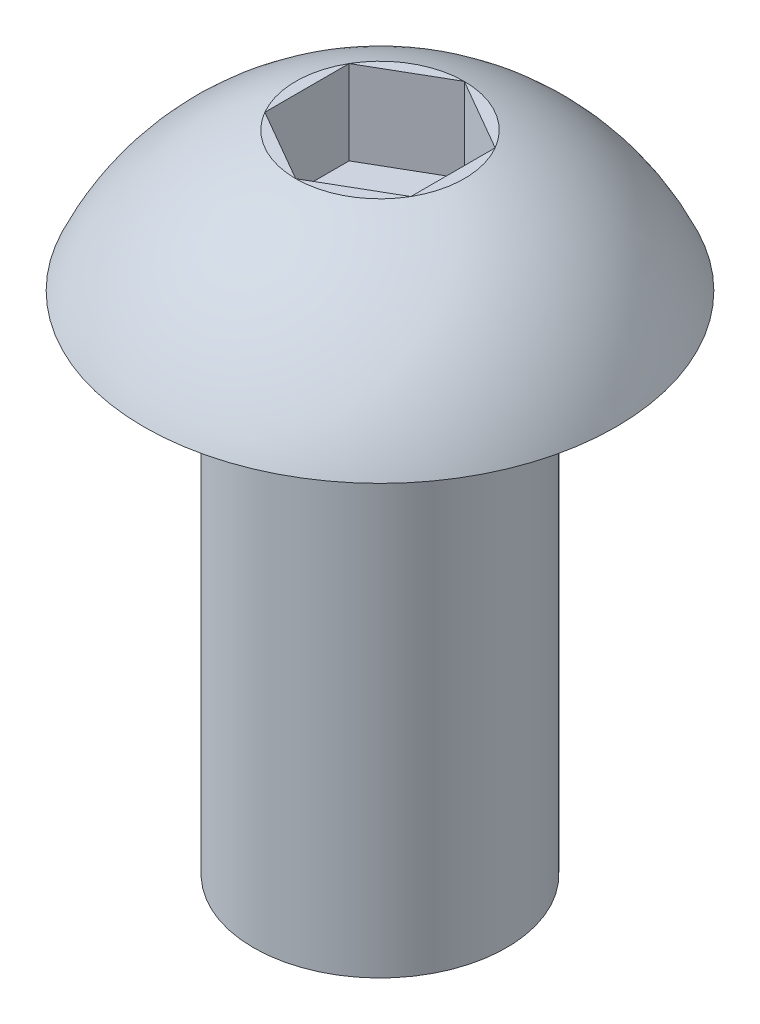
ISO-10303-21;
HEADER;
FILE_DESCRIPTION(('STEP AP214'),'2;1');
FILE_NAME('part.step','',(''),(''),'','','');
FILE_SCHEMA(('AUTOMOTIVE_DESIGN { 1 0 10303 214 1 1 1 1 }'));
ENDSEC;
DATA;
#1=APPLICATION_CONTEXT('core data for automotive mechanical design processes');
#2=APPLICATION_PROTOCOL_DEFINITION('international standard','automotive_design',2000,#1);
#3=PRODUCT_CONTEXT('',#1,'mechanical');
#4=PRODUCT('Part','Part','',(#3));
#5=PRODUCT_RELATED_PRODUCT_CATEGORY('part','',(#4));
#6=PRODUCT_DEFINITION_FORMATION('','',#4);
#7=PRODUCT_DEFINITION_CONTEXT('part definition',#1,'design');
#8=PRODUCT_DEFINITION('design','',#6,#7);
#9=PRODUCT_DEFINITION_SHAPE('','',#8);
#10=(LENGTH_UNIT() NAMED_UNIT(*) SI_UNIT(.MILLI.,.METRE.));
#11=(NAMED_UNIT(*) PLANE_ANGLE_UNIT() SI_UNIT($,.RADIAN.));
#12=(NAMED_UNIT(*) SI_UNIT($,.STERADIAN.) SOLID_ANGLE_UNIT());
#13=UNCERTAINTY_MEASURE_WITH_UNIT(LENGTH_MEASURE(1.E-05),#10,'distance_accuracy_value','');
#14=(GEOMETRIC_REPRESENTATION_CONTEXT(3) GLOBAL_UNCERTAINTY_ASSIGNED_CONTEXT((#13)) GLOBAL_UNIT_ASSIGNED_CONTEXT((#10,
#11,#12)) REPRESENTATION_CONTEXT('',''));
#15=CARTESIAN_POINT('',(0.,0.,0.));
#16=DIRECTION('',(0.,0.,1.));
#17=DIRECTION('',(1.,0.,0.));
#18=AXIS2_PLACEMENT_3D('',#15,#16,#17);
#19=CARTESIAN_POINT('',(0.,1.65,0.));
#20=DIRECTION('',(0.,1.,0.));
#21=DIRECTION('',(0.,0.,1.));
#22=AXIS2_PLACEMENT_3D('',#19,#20,#21);
#23=PLANE('',#22);
#24=DIRECTION('',(-0.866025403784439,0.,-0.5));
#25=VECTOR('',#24,1.);
#26=CARTESIAN_POINT('',(0.866025403784438,1.65,-0.5));
#27=LINE('',#26,#25);
#28=CARTESIAN_POINT('',(0.866025403784438,1.65,-0.5));
#29=VERTEX_POINT('',#28);
#30=CARTESIAN_POINT('',(0.,1.65,-1.));
#31=VERTEX_POINT('',#30);
#32=EDGE_CURVE('E50',#29,#31,#27,.T.);
#33=ORIENTED_EDGE('',*,*,#32,.F.);
#34=CARTESIAN_POINT('',(0.,1.65,0.));
#35=DIRECTION('',(0.,1.,0.));
#36=DIRECTION('',(0.,0.,1.));
#37=AXIS2_PLACEMENT_3D('',#34,#35,#36);
#38=CIRCLE('',#37,1.);
#39=EDGE_CURVE('E152',#29,#31,#38,.T.);
#40=ORIENTED_EDGE('',*,*,#39,.T.);
#41=EDGE_LOOP('',(#33,#40));
#42=FACE_BOUND('',#41,.T.);
#43=ADVANCED_FACE('F34',(#42),#23,.T.);
#44=DIRECTION('',(0.,0.,-1.));
#45=VECTOR('',#44,1.);
#46=CARTESIAN_POINT('',(0.866025403784439,1.65,0.5));
#47=LINE('',#46,#45);
#48=CARTESIAN_POINT('',(0.866025403784439,1.65,0.5));
#49=VERTEX_POINT('',#48);
#50=EDGE_CURVE('E133',#49,#29,#47,.T.);
#51=ORIENTED_EDGE('',*,*,#50,.F.);
#52=EDGE_CURVE('E147',#49,#29,#38,.T.);
#53=ORIENTED_EDGE('',*,*,#52,.T.);
#54=EDGE_LOOP('',(#51,#53));
#55=FACE_BOUND('',#54,.T.);
#56=ADVANCED_FACE('F175',(#55),#23,.T.);
#57=DIRECTION('',(0.866025403784439,0.,-0.5));
#58=VECTOR('',#57,1.);
#59=CARTESIAN_POINT('',(0.,1.65,1.));
#60=LINE('',#59,#58);
#61=CARTESIAN_POINT('',(0.,1.65,1.));
#62=VERTEX_POINT('',#61);
#63=EDGE_CURVE('E131',#62,#49,#60,.T.);
#64=ORIENTED_EDGE('',*,*,#63,.F.);
#65=EDGE_CURVE('E145',#62,#49,#38,.T.);
#66=ORIENTED_EDGE('',*,*,#65,.T.);
#67=EDGE_LOOP('',(#64,#66));
#68=FACE_BOUND('',#67,.T.);
#69=ADVANCED_FACE('F177',(#68),#23,.T.);
#70=DIRECTION('',(0.866025403784439,0.,0.5));
#71=VECTOR('',#70,1.);
#72=CARTESIAN_POINT('',(-0.866025403784439,1.65,0.5));
#73=LINE('',#72,#71);
#74=CARTESIAN_POINT('',(-0.866025403784439,1.65,0.5));
#75=VERTEX_POINT('',#74);
#76=EDGE_CURVE('E98',#75,#62,#73,.T.);
#77=ORIENTED_EDGE('',*,*,#76,.F.);
#78=EDGE_CURVE('E144',#75,#62,#38,.T.);
#79=ORIENTED_EDGE('',*,*,#78,.T.);
#80=EDGE_LOOP('',(#77,#79));
#81=FACE_BOUND('',#80,.T.);
#82=ADVANCED_FACE('F179',(#81),#23,.T.);
#83=DIRECTION('',(0.,0.,1.));
#84=VECTOR('',#83,1.);
#85=CARTESIAN_POINT('',(-0.866025403784439,1.65,-0.5));
#86=LINE('',#85,#84);
#87=CARTESIAN_POINT('',(-0.866025403784439,1.65,-0.5));
#88=VERTEX_POINT('',#87);
#89=EDGE_CURVE('E127',#88,#75,#86,.T.);
#90=ORIENTED_EDGE('',*,*,#89,.F.);
#91=EDGE_CURVE('E154',#88,#75,#38,.T.);
#92=ORIENTED_EDGE('',*,*,#91,.T.);
#93=EDGE_LOOP('',(#90,#92));
#94=FACE_BOUND('',#93,.T.);
#95=ADVANCED_FACE('F185',(#94),#23,.T.);
#96=CARTESIAN_POINT('',(0.,0.,0.));
#97=DIRECTION('',(0.,1.,0.));
#98=DIRECTION('',(0.,0.,1.));
#99=AXIS2_PLACEMENT_3D('',#96,#97,#98);
#100=PLANE('',#99);
#101=CARTESIAN_POINT('',(0.,0.,0.));
#102=DIRECTION('',(0.,-1.,0.));
#103=DIRECTION('',(0.,0.,-1.));
#104=AXIS2_PLACEMENT_3D('',#101,#102,#103);
#105=CIRCLE('',#104,1.5);
#106=CARTESIAN_POINT('',(0.,0.,-1.5));
#107=VERTEX_POINT('',#106);
#108=EDGE_CURVE('E11',#107,#107,#105,.T.);
#109=ORIENTED_EDGE('',*,*,#108,.F.);
#110=EDGE_LOOP('',(#109));
#111=FACE_BOUND('',#110,.T.);
#112=CARTESIAN_POINT('',(0.,0.,0.));
#113=DIRECTION('',(0.,1.,0.));
#114=DIRECTION('',(0.,0.,1.));
#115=AXIS2_PLACEMENT_3D('',#112,#113,#114);
#116=CIRCLE('',#115,2.8);
#117=CARTESIAN_POINT('',(0.,0.,2.8));
#118=VERTEX_POINT('',#117);
#119=EDGE_CURVE('E38',#118,#118,#116,.T.);
#120=ORIENTED_EDGE('',*,*,#119,.F.);
#121=EDGE_LOOP('',(#120));
#122=FACE_BOUND('',#121,.T.);
#123=ADVANCED_FACE('F36',(#111,#122),#100,.F.);
#124=CARTESIAN_POINT('',(0.,-1.19504109803139,0.));
#125=DIRECTION('',(0.,1.,0.));
#126=DIRECTION('',(0.,0.,1.));
#127=AXIS2_PLACEMENT_3D('',#124,#125,#126);
#128=DEGENERATE_TOROIDAL_SURFACE('',#127,0.0482956601378954,3.,.T.);
#129=ORIENTED_EDGE('',*,*,#65,.F.);
#130=ORIENTED_EDGE('',*,*,#78,.F.);
#131=ORIENTED_EDGE('',*,*,#91,.F.);
#132=EDGE_CURVE('E158',#31,#88,#38,.T.);
#133=ORIENTED_EDGE('',*,*,#132,.F.);
#134=ORIENTED_EDGE('',*,*,#39,.F.);
#135=ORIENTED_EDGE('',*,*,#52,.F.);
#136=EDGE_LOOP('',(#129,#130,#131,#133,#134,#135));
#137=FACE_BOUND('',#136,.T.);
#138=ORIENTED_EDGE('',*,*,#119,.T.);
#139=EDGE_LOOP('',(#138));
#140=FACE_BOUND('',#139,.T.);
#141=ADVANCED_FACE('F171',(#137,#140),#128,.T.);
#142=DIRECTION('',(-0.866025403784438,0.,0.5));
#143=VECTOR('',#142,1.);
#144=CARTESIAN_POINT('',(0.,1.65,-1.));
#145=LINE('',#144,#143);
#146=EDGE_CURVE('E124',#31,#88,#145,.T.);
#147=ORIENTED_EDGE('',*,*,#146,.F.);
#148=ORIENTED_EDGE('',*,*,#132,.T.);
#149=EDGE_LOOP('',(#147,#148));
#150=FACE_BOUND('',#149,.T.);
#151=ADVANCED_FACE('F186',(#150),#23,.T.);
#152=CARTESIAN_POINT('',(0.,-6.,0.));
#153=DIRECTION('',(0.,1.,0.));
#154=DIRECTION('',(0.,0.,1.));
#155=AXIS2_PLACEMENT_3D('',#152,#153,#154);
#156=CYLINDRICAL_SURFACE('',#155,1.5);
#157=CARTESIAN_POINT('',(0.,-6.,0.));
#158=DIRECTION('',(0.,-1.,0.));
#159=DIRECTION('',(0.,0.,-1.));
#160=AXIS2_PLACEMENT_3D('',#157,#158,#159);
#161=CIRCLE('',#160,1.5);
#162=CARTESIAN_POINT('',(0.,-6.,-1.5));
#163=VERTEX_POINT('',#162);
#164=EDGE_CURVE('E137',#163,#163,#161,.T.);
#165=ORIENTED_EDGE('',*,*,#164,.F.);
#166=EDGE_LOOP('',(#165));
#167=FACE_BOUND('',#166,.T.);
#168=ORIENTED_EDGE('',*,*,#108,.T.);
#169=EDGE_LOOP('',(#168));
#170=FACE_BOUND('',#169,.T.);
#171=ADVANCED_FACE('F192',(#167,#170),#156,.T.);
#172=CARTESIAN_POINT('',(0.,-6.,0.));
#173=DIRECTION('',(0.,-1.,0.));
#174=DIRECTION('',(0.,0.,-1.));
#175=AXIS2_PLACEMENT_3D('',#172,#173,#174);
#176=PLANE('',#175);
#177=ORIENTED_EDGE('',*,*,#164,.T.);
#178=EDGE_LOOP('',(#177));
#179=FACE_BOUND('',#178,.T.);
#180=ADVANCED_FACE('F197',(#179),#176,.T.);
#181=CARTESIAN_POINT('',(0.866025403784438,0.65,-0.5));
#182=DIRECTION('',(0.5,0.,-0.866025403784439));
#183=DIRECTION('',(-0.866025403784439,0.,-0.5));
#184=AXIS2_PLACEMENT_3D('',#181,#182,#183);
#185=PLANE('',#184);
#186=ORIENTED_EDGE('',*,*,#32,.T.);
#187=DIRECTION('',(0.,1.,0.));
#188=VECTOR('',#187,1.);
#189=CARTESIAN_POINT('',(0.,0.65,-1.));
#190=LINE('',#189,#188);
#191=CARTESIAN_POINT('',(0.,0.65,-1.));
#192=VERTEX_POINT('',#191);
#193=EDGE_CURVE('E80',#192,#31,#190,.T.);
#194=ORIENTED_EDGE('',*,*,#193,.F.);
#195=DIRECTION('',(-0.866025403784439,0.,-0.5));
#196=VECTOR('',#195,1.);
#197=CARTESIAN_POINT('',(0.866025403784438,0.65,-0.5));
#198=LINE('',#197,#196);
#199=CARTESIAN_POINT('',(0.866025403784438,0.65,-0.5));
#200=VERTEX_POINT('',#199);
#201=EDGE_CURVE('E135',#200,#192,#198,.T.);
#202=ORIENTED_EDGE('',*,*,#201,.F.);
#203=DIRECTION('',(0.,1.,0.));
#204=VECTOR('',#203,1.);
#205=CARTESIAN_POINT('',(0.866025403784438,0.65,-0.5));
#206=LINE('',#205,#204);
#207=EDGE_CURVE('E58',#200,#29,#206,.T.);
#208=ORIENTED_EDGE('',*,*,#207,.T.);
#209=EDGE_LOOP('',(#186,#194,#202,#208));
#210=FACE_BOUND('',#209,.T.);
#211=ADVANCED_FACE('F209',(#210),#185,.F.);
#212=CARTESIAN_POINT('',(0.866025403784439,0.65,0.5));
#213=DIRECTION('',(1.,0.,0.));
#214=DIRECTION('',(0.,0.,-1.));
#215=AXIS2_PLACEMENT_3D('',#212,#213,#214);
#216=PLANE('',#215);
#217=ORIENTED_EDGE('',*,*,#50,.T.);
#218=ORIENTED_EDGE('',*,*,#207,.F.);
#219=DIRECTION('',(0.,0.,-1.));
#220=VECTOR('',#219,1.);
#221=CARTESIAN_POINT('',(0.866025403784439,0.65,0.5));
#222=LINE('',#221,#220);
#223=CARTESIAN_POINT('',(0.866025403784439,0.65,0.5));
#224=VERTEX_POINT('',#223);
#225=EDGE_CURVE('E110',#224,#200,#222,.T.);
#226=ORIENTED_EDGE('',*,*,#225,.F.);
#227=DIRECTION('',(0.,1.,0.));
#228=VECTOR('',#227,1.);
#229=CARTESIAN_POINT('',(0.866025403784439,0.65,0.5));
#230=LINE('',#229,#228);
#231=EDGE_CURVE('E102',#224,#49,#230,.T.);
#232=ORIENTED_EDGE('',*,*,#231,.T.);
#233=EDGE_LOOP('',(#217,#218,#226,#232));
#234=FACE_BOUND('',#233,.T.);
#235=ADVANCED_FACE('F176',(#234),#216,.F.);
#236=CARTESIAN_POINT('',(0.,0.65,1.));
#237=DIRECTION('',(0.5,0.,0.866025403784439));
#238=DIRECTION('',(0.866025403784439,0.,-0.5));
#239=AXIS2_PLACEMENT_3D('',#236,#237,#238);
#240=PLANE('',#239);
#241=ORIENTED_EDGE('',*,*,#63,.T.);
#242=ORIENTED_EDGE('',*,*,#231,.F.);
#243=DIRECTION('',(0.866025403784439,0.,-0.5));
#244=VECTOR('',#243,1.);
#245=CARTESIAN_POINT('',(0.,0.65,1.));
#246=LINE('',#245,#244);
#247=CARTESIAN_POINT('',(0.,0.65,1.));
#248=VERTEX_POINT('',#247);
#249=EDGE_CURVE('E106',#248,#224,#246,.T.);
#250=ORIENTED_EDGE('',*,*,#249,.F.);
#251=DIRECTION('',(0.,1.,0.));
#252=VECTOR('',#251,1.);
#253=CARTESIAN_POINT('',(0.,0.65,1.));
#254=LINE('',#253,#252);
#255=EDGE_CURVE('E91',#248,#62,#254,.T.);
#256=ORIENTED_EDGE('',*,*,#255,.T.);
#257=EDGE_LOOP('',(#241,#242,#250,#256));
#258=FACE_BOUND('',#257,.T.);
#259=ADVANCED_FACE('F107',(#258),#240,.F.);
#260=CARTESIAN_POINT('',(-0.866025403784439,0.65,0.5));
#261=DIRECTION('',(-0.5,0.,0.866025403784439));
#262=DIRECTION('',(0.866025403784439,0.,0.5));
#263=AXIS2_PLACEMENT_3D('',#260,#261,#262);
#264=PLANE('',#263);
#265=ORIENTED_EDGE('',*,*,#76,.T.);
#266=ORIENTED_EDGE('',*,*,#255,.F.);
#267=DIRECTION('',(0.866025403784439,0.,0.5));
#268=VECTOR('',#267,1.);
#269=CARTESIAN_POINT('',(-0.866025403784439,0.65,0.5));
#270=LINE('',#269,#268);
#271=CARTESIAN_POINT('',(-0.866025403784439,0.65,0.5));
#272=VERTEX_POINT('',#271);
#273=EDGE_CURVE('E95',#272,#248,#270,.T.);
#274=ORIENTED_EDGE('',*,*,#273,.F.);
#275=DIRECTION('',(0.,1.,0.));
#276=VECTOR('',#275,1.);
#277=CARTESIAN_POINT('',(-0.866025403784439,0.65,0.5));
#278=LINE('',#277,#276);
#279=EDGE_CURVE('E103',#272,#75,#278,.T.);
#280=ORIENTED_EDGE('',*,*,#279,.T.);
#281=EDGE_LOOP('',(#265,#266,#274,#280));
#282=FACE_BOUND('',#281,.T.);
#283=ADVANCED_FACE('F93',(#282),#264,.F.);
#284=CARTESIAN_POINT('',(-0.866025403784439,0.65,-0.5));
#285=DIRECTION('',(-1.,0.,0.));
#286=DIRECTION('',(0.,0.,1.));
#287=AXIS2_PLACEMENT_3D('',#284,#285,#286);
#288=PLANE('',#287);
#289=ORIENTED_EDGE('',*,*,#89,.T.);
#290=ORIENTED_EDGE('',*,*,#279,.F.);
#291=DIRECTION('',(0.,0.,1.));
#292=VECTOR('',#291,1.);
#293=CARTESIAN_POINT('',(-0.866025403784439,0.65,-0.5));
#294=LINE('',#293,#292);
#295=CARTESIAN_POINT('',(-0.866025403784439,0.65,-0.5));
#296=VERTEX_POINT('',#295);
#297=EDGE_CURVE('E116',#296,#272,#294,.T.);
#298=ORIENTED_EDGE('',*,*,#297,.F.);
#299=DIRECTION('',(0.,1.,0.));
#300=VECTOR('',#299,1.);
#301=CARTESIAN_POINT('',(-0.866025403784439,0.65,-0.5));
#302=LINE('',#301,#300);
#303=EDGE_CURVE('E140',#296,#88,#302,.T.);
#304=ORIENTED_EDGE('',*,*,#303,.T.);
#305=EDGE_LOOP('',(#289,#290,#298,#304));
#306=FACE_BOUND('',#305,.T.);
#307=ADVANCED_FACE('F205',(#306),#288,.F.);
#308=CARTESIAN_POINT('',(0.,0.65,-1.));
#309=DIRECTION('',(-0.5,0.,-0.866025403784439));
#310=DIRECTION('',(-0.866025403784438,0.,0.5));
#311=AXIS2_PLACEMENT_3D('',#308,#309,#310);
#312=PLANE('',#311);
#313=ORIENTED_EDGE('',*,*,#146,.T.);
#314=ORIENTED_EDGE('',*,*,#303,.F.);
#315=DIRECTION('',(-0.866025403784438,0.,0.5));
#316=VECTOR('',#315,1.);
#317=CARTESIAN_POINT('',(0.,0.65,-1.));
#318=LINE('',#317,#316);
#319=EDGE_CURVE('E118',#192,#296,#318,.T.);
#320=ORIENTED_EDGE('',*,*,#319,.F.);
#321=ORIENTED_EDGE('',*,*,#193,.T.);
#322=EDGE_LOOP('',(#313,#314,#320,#321));
#323=FACE_BOUND('',#322,.T.);
#324=ADVANCED_FACE('F207',(#323),#312,.F.);
#325=CARTESIAN_POINT('',(0.,0.65,0.));
#326=DIRECTION('',(0.,1.,0.));
#327=DIRECTION('',(0.,0.,1.));
#328=AXIS2_PLACEMENT_3D('',#325,#326,#327);
#329=PLANE('',#328);
#330=ORIENTED_EDGE('',*,*,#201,.T.);
#331=ORIENTED_EDGE('',*,*,#319,.T.);
#332=ORIENTED_EDGE('',*,*,#297,.T.);
#333=ORIENTED_EDGE('',*,*,#273,.T.);
#334=ORIENTED_EDGE('',*,*,#249,.T.);
#335=ORIENTED_EDGE('',*,*,#225,.T.);
#336=EDGE_LOOP('',(#330,#331,#332,#333,#334,#335));
#337=FACE_BOUND('',#336,.T.);
#338=ADVANCED_FACE('F113',(#337),#329,.T.);
#339=CLOSED_SHELL('',(#43,#56,#69,#82,#95,#123,#141,#151,#171,#180,#211,#235,#259,#283,#307,
#324,#338));
#340=MANIFOLD_SOLID_BREP('B2',#339);
#341=ADVANCED_BREP_SHAPE_REPRESENTATION('',(#18,#340),#14);
#342=SHAPE_DEFINITION_REPRESENTATION(#9,#341);
ENDSEC;
END-ISO-10303-21;
